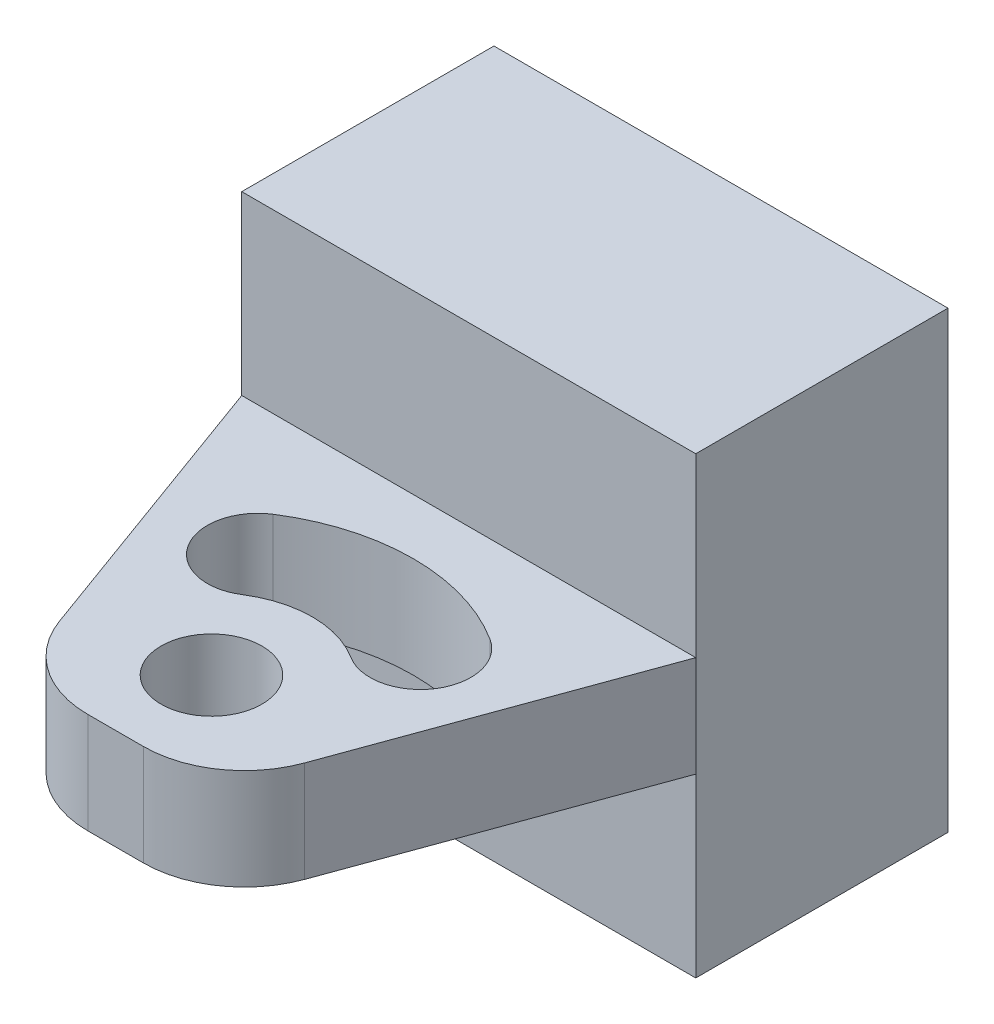
ISO-10303-21;
HEADER;
FILE_DESCRIPTION(('STEP AP214'),'2;1');
FILE_NAME('part.step','',(''),(''),'','','');
FILE_SCHEMA(('AUTOMOTIVE_DESIGN { 1 0 10303 214 1 1 1 1 }'));
ENDSEC;
DATA;
#1=APPLICATION_CONTEXT('core data for automotive mechanical design processes');
#2=APPLICATION_PROTOCOL_DEFINITION('international standard','automotive_design',2000,#1);
#3=PRODUCT_CONTEXT('',#1,'mechanical');
#4=PRODUCT('Part','Part','',(#3));
#5=PRODUCT_RELATED_PRODUCT_CATEGORY('part','',(#4));
#6=PRODUCT_DEFINITION_FORMATION('','',#4);
#7=PRODUCT_DEFINITION_CONTEXT('part definition',#1,'design');
#8=PRODUCT_DEFINITION('design','',#6,#7);
#9=PRODUCT_DEFINITION_SHAPE('','',#8);
#10=(LENGTH_UNIT() NAMED_UNIT(*) SI_UNIT(.MILLI.,.METRE.));
#11=(NAMED_UNIT(*) PLANE_ANGLE_UNIT() SI_UNIT($,.RADIAN.));
#12=(NAMED_UNIT(*) SI_UNIT($,.STERADIAN.) SOLID_ANGLE_UNIT());
#13=UNCERTAINTY_MEASURE_WITH_UNIT(LENGTH_MEASURE(1.E-05),#10,'distance_accuracy_value','');
#14=(GEOMETRIC_REPRESENTATION_CONTEXT(3) GLOBAL_UNCERTAINTY_ASSIGNED_CONTEXT((#13)) GLOBAL_UNIT_ASSIGNED_CONTEXT((#10,
#11,#12)) REPRESENTATION_CONTEXT('',''));
#15=CARTESIAN_POINT('',(0.,0.,0.));
#16=DIRECTION('',(0.,0.,1.));
#17=DIRECTION('',(1.,0.,0.));
#18=AXIS2_PLACEMENT_3D('',#15,#16,#17);
#19=CARTESIAN_POINT('',(0.,0.,25.));
#20=DIRECTION('',(1.,0.,0.));
#21=DIRECTION('',(0.,1.,0.));
#22=AXIS2_PLACEMENT_3D('',#19,#20,#21);
#23=PLANE('',#22);
#24=DIRECTION('',(0.,-1.,0.));
#25=VECTOR('',#24,1.);
#26=CARTESIAN_POINT('',(0.,45.,25.));
#27=LINE('',#26,#25);
#28=CARTESIAN_POINT('',(0.,27.5,25.));
#29=VERTEX_POINT('',#28);
#30=CARTESIAN_POINT('',(0.,17.5,25.));
#31=VERTEX_POINT('',#30);
#32=EDGE_CURVE('E140',#29,#31,#27,.T.);
#33=ORIENTED_EDGE('',*,*,#32,.F.);
#34=DIRECTION('',(0.,-1.,0.));
#35=VECTOR('',#34,1.);
#36=CARTESIAN_POINT('',(0.,0.,25.));
#37=LINE('',#36,#35);
#38=CARTESIAN_POINT('',(0.,45.,25.));
#39=VERTEX_POINT('',#38);
#40=EDGE_CURVE('E153',#39,#29,#37,.T.);
#41=ORIENTED_EDGE('',*,*,#40,.F.);
#42=DIRECTION('',(0.,0.,-1.));
#43=VECTOR('',#42,1.);
#44=CARTESIAN_POINT('',(0.,45.,25.));
#45=LINE('',#44,#43);
#46=CARTESIAN_POINT('',(0.,45.,0.));
#47=VERTEX_POINT('',#46);
#48=EDGE_CURVE('E195',#39,#47,#45,.T.);
#49=ORIENTED_EDGE('',*,*,#48,.T.);
#50=DIRECTION('',(0.,-1.,0.));
#51=VECTOR('',#50,1.);
#52=CARTESIAN_POINT('',(0.,0.,0.));
#53=LINE('',#52,#51);
#54=CARTESIAN_POINT('',(0.,0.,0.));
#55=VERTEX_POINT('',#54);
#56=EDGE_CURVE('E196',#47,#55,#53,.T.);
#57=ORIENTED_EDGE('',*,*,#56,.T.);
#58=DIRECTION('',(0.,0.,-1.));
#59=VECTOR('',#58,1.);
#60=CARTESIAN_POINT('',(0.,0.,25.));
#61=LINE('',#60,#59);
#62=CARTESIAN_POINT('',(0.,0.,25.));
#63=VERTEX_POINT('',#62);
#64=EDGE_CURVE('E219',#63,#55,#61,.T.);
#65=ORIENTED_EDGE('',*,*,#64,.F.);
#66=EDGE_CURVE('E155',#31,#63,#37,.T.);
#67=ORIENTED_EDGE('',*,*,#66,.F.);
#68=EDGE_LOOP('',(#33,#41,#49,#57,#65,#67));
#69=FACE_BOUND('',#68,.T.);
#70=ADVANCED_FACE('F37',(#69),#23,.F.);
#71=CARTESIAN_POINT('',(45.,0.,25.));
#72=DIRECTION('',(-1.,0.,0.));
#73=DIRECTION('',(0.,-1.,0.));
#74=AXIS2_PLACEMENT_3D('',#71,#72,#73);
#75=PLANE('',#74);
#76=DIRECTION('',(0.,-1.,0.));
#77=VECTOR('',#76,1.);
#78=CARTESIAN_POINT('',(45.,45.,25.));
#79=LINE('',#78,#77);
#80=CARTESIAN_POINT('',(45.,27.5,25.));
#81=VERTEX_POINT('',#80);
#82=CARTESIAN_POINT('',(45.,17.5,25.));
#83=VERTEX_POINT('',#82);
#84=EDGE_CURVE('E146',#81,#83,#79,.T.);
#85=ORIENTED_EDGE('',*,*,#84,.T.);
#86=DIRECTION('',(0.,1.,0.));
#87=VECTOR('',#86,1.);
#88=CARTESIAN_POINT('',(45.,0.,25.));
#89=LINE('',#88,#87);
#90=CARTESIAN_POINT('',(45.,0.,25.));
#91=VERTEX_POINT('',#90);
#92=EDGE_CURVE('E189',#91,#83,#89,.T.);
#93=ORIENTED_EDGE('',*,*,#92,.F.);
#94=DIRECTION('',(0.,0.,-1.));
#95=VECTOR('',#94,1.);
#96=CARTESIAN_POINT('',(45.,0.,25.));
#97=LINE('',#96,#95);
#98=CARTESIAN_POINT('',(45.,0.,0.));
#99=VERTEX_POINT('',#98);
#100=EDGE_CURVE('E215',#91,#99,#97,.T.);
#101=ORIENTED_EDGE('',*,*,#100,.T.);
#102=DIRECTION('',(0.,1.,0.));
#103=VECTOR('',#102,1.);
#104=CARTESIAN_POINT('',(45.,0.,0.));
#105=LINE('',#104,#103);
#106=CARTESIAN_POINT('',(45.,45.,0.));
#107=VERTEX_POINT('',#106);
#108=EDGE_CURVE('E203',#99,#107,#105,.T.);
#109=ORIENTED_EDGE('',*,*,#108,.T.);
#110=DIRECTION('',(0.,0.,-1.));
#111=VECTOR('',#110,1.);
#112=CARTESIAN_POINT('',(45.,45.,25.));
#113=LINE('',#112,#111);
#114=CARTESIAN_POINT('',(45.,45.,25.));
#115=VERTEX_POINT('',#114);
#116=EDGE_CURVE('E211',#115,#107,#113,.T.);
#117=ORIENTED_EDGE('',*,*,#116,.F.);
#118=EDGE_CURVE('E188',#81,#115,#89,.T.);
#119=ORIENTED_EDGE('',*,*,#118,.F.);
#120=EDGE_LOOP('',(#85,#93,#101,#109,#117,#119));
#121=FACE_BOUND('',#120,.T.);
#122=ADVANCED_FACE('F343',(#121),#75,.F.);
#123=CARTESIAN_POINT('',(0.,17.5,60.));
#124=DIRECTION('',(0.,1.,0.));
#125=DIRECTION('',(0.,0.,1.));
#126=AXIS2_PLACEMENT_3D('',#123,#124,#125);
#127=PLANE('',#126);
#128=CARTESIAN_POINT('',(22.5,17.5,50.5));
#129=DIRECTION('',(0.,-1.,0.));
#130=DIRECTION('',(0.,0.,-1.));
#131=AXIS2_PLACEMENT_3D('',#128,#129,#130);
#132=CIRCLE('',#131,5.);
#133=CARTESIAN_POINT('',(22.5,17.5,45.5));
#134=VERTEX_POINT('',#133);
#135=EDGE_CURVE('E243',#134,#134,#132,.T.);
#136=ORIENTED_EDGE('',*,*,#135,.F.);
#137=EDGE_LOOP('',(#136));
#138=FACE_BOUND('',#137,.T.);
#139=CARTESIAN_POINT('',(14.4405058747976,17.5,37.8491283128067));
#140=DIRECTION('',(0.,-1.,0.));
#141=DIRECTION('',(0.,0.,-1.));
#142=AXIS2_PLACEMENT_3D('',#139,#140,#141);
#143=CIRCLE('',#142,5.);
#144=CARTESIAN_POINT('',(17.1270039165317,17.5,42.0660855418711));
#145=VERTEX_POINT('',#144);
#146=CARTESIAN_POINT('',(11.7540078330635,17.5,33.6321710837423));
#147=VERTEX_POINT('',#146);
#148=EDGE_CURVE('E290',#145,#147,#143,.T.);
#149=ORIENTED_EDGE('',*,*,#148,.F.);
#150=CARTESIAN_POINT('',(22.5,17.5,50.5));
#151=DIRECTION('',(0.,1.,0.));
#152=DIRECTION('',(0.,0.,-1.));
#153=AXIS2_PLACEMENT_3D('',#150,#151,#152);
#154=CIRCLE('',#153,10.);
#155=CARTESIAN_POINT('',(27.8729960834682,17.5,42.0660855418711));
#156=VERTEX_POINT('',#155);
#157=EDGE_CURVE('E283',#156,#145,#154,.T.);
#158=ORIENTED_EDGE('',*,*,#157,.F.);
#159=CARTESIAN_POINT('',(30.5594941252023,17.5,37.8491283128067));
#160=DIRECTION('',(0.,-1.,0.));
#161=DIRECTION('',(0.,0.,-1.));
#162=AXIS2_PLACEMENT_3D('',#159,#160,#161);
#163=CIRCLE('',#162,5.00000000000001);
#164=CARTESIAN_POINT('',(33.2459921669364,17.5,33.6321710837422));
#165=VERTEX_POINT('',#164);
#166=EDGE_CURVE('E298',#165,#156,#163,.T.);
#167=ORIENTED_EDGE('',*,*,#166,.F.);
#168=CARTESIAN_POINT('',(22.5,17.5,50.5));
#169=DIRECTION('',(0.,-1.,0.));
#170=DIRECTION('',(0.,0.,-1.));
#171=AXIS2_PLACEMENT_3D('',#168,#169,#170);
#172=CIRCLE('',#171,20.);
#173=EDGE_CURVE('E294',#147,#165,#172,.T.);
#174=ORIENTED_EDGE('',*,*,#173,.F.);
#175=EDGE_LOOP('',(#149,#158,#167,#174));
#176=FACE_BOUND('',#175,.T.);
#177=DIRECTION('',(1.,0.,0.));
#178=VECTOR('',#177,1.);
#179=CARTESIAN_POINT('',(0.,17.5,60.));
#180=LINE('',#179,#178);
#181=CARTESIAN_POINT('',(19.741033581414,17.5,60.));
#182=VERTEX_POINT('',#181);
#183=CARTESIAN_POINT('',(25.258966418586,17.5,60.));
#184=VERTEX_POINT('',#183);
#185=EDGE_CURVE('E172',#182,#184,#180,.T.);
#186=ORIENTED_EDGE('',*,*,#185,.F.);
#187=CARTESIAN_POINT('',(19.741033581414,17.5,50.));
#188=DIRECTION('',(0.,1.,0.));
#189=DIRECTION('',(0.,0.,1.));
#190=AXIS2_PLACEMENT_3D('',#187,#188,#189);
#191=CIRCLE('',#190,10.);
#192=CARTESIAN_POINT('',(10.3441073735549,17.5,53.4202014332566));
#193=VERTEX_POINT('',#192);
#194=EDGE_CURVE('E254',#182,#193,#191,.F.);
#195=ORIENTED_EDGE('',*,*,#194,.T.);
#196=DIRECTION('',(0.342020143325663,0.,0.939692620785911));
#197=VECTOR('',#196,1.);
#198=CARTESIAN_POINT('',(11.2487831695143,17.5,55.9057777545823));
#199=LINE('',#198,#197);
#200=EDGE_CURVE('E145',#31,#193,#199,.T.);
#201=ORIENTED_EDGE('',*,*,#200,.F.);
#202=DIRECTION('',(1.,0.,0.));
#203=VECTOR('',#202,1.);
#204=CARTESIAN_POINT('',(0.,17.5,25.));
#205=LINE('',#204,#203);
#206=EDGE_CURVE('E173',#31,#83,#205,.T.);
#207=ORIENTED_EDGE('',*,*,#206,.T.);
#208=DIRECTION('',(0.342020143325663,0.,-0.939692620785911));
#209=VECTOR('',#208,1.);
#210=CARTESIAN_POINT('',(28.4872168006629,17.5,70.3684989725292));
#211=LINE('',#210,#209);
#212=CARTESIAN_POINT('',(34.6558926264451,17.5,53.4202014332566));
#213=VERTEX_POINT('',#212);
#214=EDGE_CURVE('E278',#213,#83,#211,.T.);
#215=ORIENTED_EDGE('',*,*,#214,.F.);
#216=CARTESIAN_POINT('',(25.258966418586,17.5,50.));
#217=DIRECTION('',(0.,1.,0.));
#218=DIRECTION('',(0.,0.,1.));
#219=AXIS2_PLACEMENT_3D('',#216,#217,#218);
#220=CIRCLE('',#219,10.);
#221=EDGE_CURVE('E251',#213,#184,#220,.F.);
#222=ORIENTED_EDGE('',*,*,#221,.T.);
#223=EDGE_LOOP('',(#186,#195,#201,#207,#215,#222));
#224=FACE_BOUND('',#223,.T.);
#225=ADVANCED_FACE('F272',(#138,#176,#224),#127,.F.);
#226=CARTESIAN_POINT('',(0.,27.5,60.));
#227=DIRECTION('',(0.,-1.,0.));
#228=DIRECTION('',(0.,0.,-1.));
#229=AXIS2_PLACEMENT_3D('',#226,#227,#228);
#230=PLANE('',#229);
#231=CARTESIAN_POINT('',(22.5,27.5,50.5));
#232=DIRECTION('',(0.,-1.,0.));
#233=DIRECTION('',(0.,0.,-1.));
#234=AXIS2_PLACEMENT_3D('',#231,#232,#233);
#235=CIRCLE('',#234,5.);
#236=CARTESIAN_POINT('',(22.5,27.5,45.5));
#237=VERTEX_POINT('',#236);
#238=EDGE_CURVE('E182',#237,#237,#235,.T.);
#239=ORIENTED_EDGE('',*,*,#238,.T.);
#240=EDGE_LOOP('',(#239));
#241=FACE_BOUND('',#240,.T.);
#242=CARTESIAN_POINT('',(30.5594941252023,27.5,37.8491283128067));
#243=DIRECTION('',(0.,-1.,0.));
#244=DIRECTION('',(0.,0.,-1.));
#245=AXIS2_PLACEMENT_3D('',#242,#243,#244);
#246=CIRCLE('',#245,5.00000000000001);
#247=CARTESIAN_POINT('',(33.2459921669364,27.5,33.6321710837422));
#248=VERTEX_POINT('',#247);
#249=CARTESIAN_POINT('',(27.8729960834682,27.5,42.0660855418711));
#250=VERTEX_POINT('',#249);
#251=EDGE_CURVE('E231',#248,#250,#246,.T.);
#252=ORIENTED_EDGE('',*,*,#251,.T.);
#253=CARTESIAN_POINT('',(22.5,27.5,50.5));
#254=DIRECTION('',(0.,-1.,0.));
#255=DIRECTION('',(0.,0.,-1.));
#256=AXIS2_PLACEMENT_3D('',#253,#254,#255);
#257=CIRCLE('',#256,10.);
#258=CARTESIAN_POINT('',(17.1270039165317,27.5,42.0660855418711));
#259=VERTEX_POINT('',#258);
#260=EDGE_CURVE('E235',#250,#259,#257,.F.);
#261=ORIENTED_EDGE('',*,*,#260,.T.);
#262=CARTESIAN_POINT('',(14.4405058747976,27.5,37.8491283128067));
#263=DIRECTION('',(0.,-1.,0.));
#264=DIRECTION('',(0.,0.,-1.));
#265=AXIS2_PLACEMENT_3D('',#262,#263,#264);
#266=CIRCLE('',#265,5.);
#267=CARTESIAN_POINT('',(11.7540078330635,27.5,33.6321710837423));
#268=VERTEX_POINT('',#267);
#269=EDGE_CURVE('E223',#259,#268,#266,.T.);
#270=ORIENTED_EDGE('',*,*,#269,.T.);
#271=CARTESIAN_POINT('',(22.5,27.5,50.5));
#272=DIRECTION('',(0.,-1.,0.));
#273=DIRECTION('',(0.,0.,-1.));
#274=AXIS2_PLACEMENT_3D('',#271,#272,#273);
#275=CIRCLE('',#274,20.);
#276=EDGE_CURVE('E227',#268,#248,#275,.T.);
#277=ORIENTED_EDGE('',*,*,#276,.T.);
#278=EDGE_LOOP('',(#252,#261,#270,#277));
#279=FACE_BOUND('',#278,.T.);
#280=DIRECTION('',(-0.342020143325663,0.,-0.939692620785911));
#281=VECTOR('',#280,1.);
#282=CARTESIAN_POINT('',(11.2487831695143,27.5,55.9057777545823));
#283=LINE('',#282,#281);
#284=CARTESIAN_POINT('',(10.3441073735549,27.5,53.4202014332566));
#285=VERTEX_POINT('',#284);
#286=EDGE_CURVE('E137',#285,#29,#283,.T.);
#287=ORIENTED_EDGE('',*,*,#286,.F.);
#288=CARTESIAN_POINT('',(19.741033581414,27.5,50.));
#289=DIRECTION('',(0.,-1.,0.));
#290=DIRECTION('',(0.,0.,-1.));
#291=AXIS2_PLACEMENT_3D('',#288,#289,#290);
#292=CIRCLE('',#291,10.);
#293=CARTESIAN_POINT('',(19.741033581414,27.5,60.));
#294=VERTEX_POINT('',#293);
#295=EDGE_CURVE('E46',#285,#294,#292,.F.);
#296=ORIENTED_EDGE('',*,*,#295,.T.);
#297=DIRECTION('',(-1.,0.,0.));
#298=VECTOR('',#297,1.);
#299=CARTESIAN_POINT('',(0.,27.5,60.));
#300=LINE('',#299,#298);
#301=CARTESIAN_POINT('',(25.258966418586,27.5,60.));
#302=VERTEX_POINT('',#301);
#303=EDGE_CURVE('E179',#302,#294,#300,.T.);
#304=ORIENTED_EDGE('',*,*,#303,.F.);
#305=CARTESIAN_POINT('',(25.258966418586,27.5,50.));
#306=DIRECTION('',(0.,-1.,0.));
#307=DIRECTION('',(0.,0.,-1.));
#308=AXIS2_PLACEMENT_3D('',#305,#306,#307);
#309=CIRCLE('',#308,10.);
#310=CARTESIAN_POINT('',(34.6558926264451,27.5,53.4202014332566));
#311=VERTEX_POINT('',#310);
#312=EDGE_CURVE('E53',#302,#311,#309,.F.);
#313=ORIENTED_EDGE('',*,*,#312,.T.);
#314=DIRECTION('',(-0.342020143325663,0.,0.939692620785911));
#315=VECTOR('',#314,1.);
#316=CARTESIAN_POINT('',(28.4872168006629,27.5,70.3684989725292));
#317=LINE('',#316,#315);
#318=EDGE_CURVE('E170',#81,#311,#317,.T.);
#319=ORIENTED_EDGE('',*,*,#318,.F.);
#320=DIRECTION('',(-1.,0.,0.));
#321=VECTOR('',#320,1.);
#322=CARTESIAN_POINT('',(0.,27.5,25.));
#323=LINE('',#322,#321);
#324=EDGE_CURVE('E161',#81,#29,#323,.T.);
#325=ORIENTED_EDGE('',*,*,#324,.T.);
#326=EDGE_LOOP('',(#287,#296,#304,#313,#319,#325));
#327=FACE_BOUND('',#326,.T.);
#328=ADVANCED_FACE('F169',(#241,#279,#327),#230,.F.);
#329=CARTESIAN_POINT('',(0.,0.,60.));
#330=DIRECTION('',(0.,0.,1.));
#331=DIRECTION('',(1.,0.,0.));
#332=AXIS2_PLACEMENT_3D('',#329,#330,#331);
#333=PLANE('',#332);
#334=ORIENTED_EDGE('',*,*,#303,.T.);
#335=DIRECTION('',(0.,-1.,0.));
#336=VECTOR('',#335,1.);
#337=CARTESIAN_POINT('',(19.741033581414,0.,60.));
#338=LINE('',#337,#336);
#339=EDGE_CURVE('E247',#294,#182,#338,.T.);
#340=ORIENTED_EDGE('',*,*,#339,.T.);
#341=ORIENTED_EDGE('',*,*,#185,.T.);
#342=DIRECTION('',(0.,1.,0.));
#343=VECTOR('',#342,1.);
#344=CARTESIAN_POINT('',(25.258966418586,0.,60.));
#345=LINE('',#344,#343);
#346=EDGE_CURVE('E239',#184,#302,#345,.T.);
#347=ORIENTED_EDGE('',*,*,#346,.T.);
#348=EDGE_LOOP('',(#334,#340,#341,#347));
#349=FACE_BOUND('',#348,.T.);
#350=ADVANCED_FACE('F266',(#349),#333,.T.);
#351=CARTESIAN_POINT('',(0.,0.,25.));
#352=DIRECTION('',(0.,0.,-1.));
#353=DIRECTION('',(-1.,0.,0.));
#354=AXIS2_PLACEMENT_3D('',#351,#352,#353);
#355=PLANE('',#354);
#356=ORIENTED_EDGE('',*,*,#324,.F.);
#357=ORIENTED_EDGE('',*,*,#118,.T.);
#358=DIRECTION('',(-1.,0.,0.));
#359=VECTOR('',#358,1.);
#360=CARTESIAN_POINT('',(0.,45.,25.));
#361=LINE('',#360,#359);
#362=EDGE_CURVE('E164',#115,#39,#361,.T.);
#363=ORIENTED_EDGE('',*,*,#362,.T.);
#364=ORIENTED_EDGE('',*,*,#40,.T.);
#365=EDGE_LOOP('',(#356,#357,#363,#364));
#366=FACE_BOUND('',#365,.T.);
#367=ADVANCED_FACE('F160',(#366),#355,.F.);
#368=ORIENTED_EDGE('',*,*,#206,.F.);
#369=ORIENTED_EDGE('',*,*,#66,.T.);
#370=DIRECTION('',(1.,0.,0.));
#371=VECTOR('',#370,1.);
#372=CARTESIAN_POINT('',(0.,0.,25.));
#373=LINE('',#372,#371);
#374=EDGE_CURVE('E167',#63,#91,#373,.T.);
#375=ORIENTED_EDGE('',*,*,#374,.T.);
#376=ORIENTED_EDGE('',*,*,#92,.T.);
#377=EDGE_LOOP('',(#368,#369,#375,#376));
#378=FACE_BOUND('',#377,.T.);
#379=ADVANCED_FACE('F388',(#378),#355,.F.);
#380=CARTESIAN_POINT('',(0.,0.,25.));
#381=DIRECTION('',(0.,1.,0.));
#382=DIRECTION('',(0.,0.,1.));
#383=AXIS2_PLACEMENT_3D('',#380,#381,#382);
#384=PLANE('',#383);
#385=DIRECTION('',(1.,0.,0.));
#386=VECTOR('',#385,1.);
#387=CARTESIAN_POINT('',(0.,0.,0.));
#388=LINE('',#387,#386);
#389=EDGE_CURVE('E200',#55,#99,#388,.T.);
#390=ORIENTED_EDGE('',*,*,#389,.T.);
#391=ORIENTED_EDGE('',*,*,#100,.F.);
#392=ORIENTED_EDGE('',*,*,#374,.F.);
#393=ORIENTED_EDGE('',*,*,#64,.T.);
#394=EDGE_LOOP('',(#390,#391,#392,#393));
#395=FACE_BOUND('',#394,.T.);
#396=ADVANCED_FACE('F351',(#395),#384,.F.);
#397=CARTESIAN_POINT('',(0.,45.,25.));
#398=DIRECTION('',(0.,-1.,0.));
#399=DIRECTION('',(1.,0.,0.));
#400=AXIS2_PLACEMENT_3D('',#397,#398,#399);
#401=PLANE('',#400);
#402=DIRECTION('',(-1.,0.,0.));
#403=VECTOR('',#402,1.);
#404=CARTESIAN_POINT('',(0.,45.,0.));
#405=LINE('',#404,#403);
#406=EDGE_CURVE('E206',#107,#47,#405,.T.);
#407=ORIENTED_EDGE('',*,*,#406,.T.);
#408=ORIENTED_EDGE('',*,*,#48,.F.);
#409=ORIENTED_EDGE('',*,*,#362,.F.);
#410=ORIENTED_EDGE('',*,*,#116,.T.);
#411=EDGE_LOOP('',(#407,#408,#409,#410));
#412=FACE_BOUND('',#411,.T.);
#413=ADVANCED_FACE('F391',(#412),#401,.F.);
#414=CARTESIAN_POINT('',(0.,0.,0.));
#415=DIRECTION('',(0.,0.,-1.));
#416=DIRECTION('',(-1.,0.,0.));
#417=AXIS2_PLACEMENT_3D('',#414,#415,#416);
#418=PLANE('',#417);
#419=ORIENTED_EDGE('',*,*,#56,.F.);
#420=ORIENTED_EDGE('',*,*,#406,.F.);
#421=ORIENTED_EDGE('',*,*,#108,.F.);
#422=ORIENTED_EDGE('',*,*,#389,.F.);
#423=EDGE_LOOP('',(#419,#420,#421,#422));
#424=FACE_BOUND('',#423,.T.);
#425=ADVANCED_FACE('F339',(#424),#418,.T.);
#426=CARTESIAN_POINT('',(22.5,45.,50.5));
#427=DIRECTION('',(0.,-1.,0.));
#428=DIRECTION('',(0.,0.,-1.));
#429=AXIS2_PLACEMENT_3D('',#426,#427,#428);
#430=CYLINDRICAL_SURFACE('',#429,10.);
#431=DIRECTION('',(0.,-1.,0.));
#432=VECTOR('',#431,1.);
#433=CARTESIAN_POINT('',(27.8729960834682,45.,42.0660855418711));
#434=LINE('',#433,#432);
#435=EDGE_CURVE('E287',#250,#156,#434,.T.);
#436=ORIENTED_EDGE('',*,*,#435,.T.);
#437=ORIENTED_EDGE('',*,*,#157,.T.);
#438=DIRECTION('',(0.,-1.,0.));
#439=VECTOR('',#438,1.);
#440=CARTESIAN_POINT('',(17.1270039165317,45.,42.0660855418711));
#441=LINE('',#440,#439);
#442=EDGE_CURVE('E302',#259,#145,#441,.T.);
#443=ORIENTED_EDGE('',*,*,#442,.F.);
#444=ORIENTED_EDGE('',*,*,#260,.F.);
#445=EDGE_LOOP('',(#436,#437,#443,#444));
#446=FACE_BOUND('',#445,.T.);
#447=ADVANCED_FACE('F329',(#446),#430,.T.);
#448=CARTESIAN_POINT('',(30.5594941252023,45.,37.8491283128067));
#449=DIRECTION('',(0.,-1.,0.));
#450=DIRECTION('',(0.,0.,-1.));
#451=AXIS2_PLACEMENT_3D('',#448,#449,#450);
#452=CYLINDRICAL_SURFACE('',#451,5.00000000000001);
#453=DIRECTION('',(0.,-1.,0.));
#454=VECTOR('',#453,1.);
#455=CARTESIAN_POINT('',(33.2459921669364,45.,33.6321710837422));
#456=LINE('',#455,#454);
#457=EDGE_CURVE('E305',#248,#165,#456,.T.);
#458=ORIENTED_EDGE('',*,*,#457,.T.);
#459=ORIENTED_EDGE('',*,*,#166,.T.);
#460=ORIENTED_EDGE('',*,*,#435,.F.);
#461=ORIENTED_EDGE('',*,*,#251,.F.);
#462=EDGE_LOOP('',(#458,#459,#460,#461));
#463=FACE_BOUND('',#462,.T.);
#464=ADVANCED_FACE('F331',(#463),#452,.F.);
#465=CARTESIAN_POINT('',(22.5,45.,50.5));
#466=DIRECTION('',(0.,-1.,0.));
#467=DIRECTION('',(0.,0.,-1.));
#468=AXIS2_PLACEMENT_3D('',#465,#466,#467);
#469=CYLINDRICAL_SURFACE('',#468,20.);
#470=DIRECTION('',(0.,-1.,0.));
#471=VECTOR('',#470,1.);
#472=CARTESIAN_POINT('',(11.7540078330635,45.,33.6321710837423));
#473=LINE('',#472,#471);
#474=EDGE_CURVE('E308',#268,#147,#473,.T.);
#475=ORIENTED_EDGE('',*,*,#474,.T.);
#476=ORIENTED_EDGE('',*,*,#173,.T.);
#477=ORIENTED_EDGE('',*,*,#457,.F.);
#478=ORIENTED_EDGE('',*,*,#276,.F.);
#479=EDGE_LOOP('',(#475,#476,#477,#478));
#480=FACE_BOUND('',#479,.T.);
#481=ADVANCED_FACE('F325',(#480),#469,.F.);
#482=CARTESIAN_POINT('',(14.4405058747976,45.,37.8491283128067));
#483=DIRECTION('',(0.,-1.,0.));
#484=DIRECTION('',(0.,0.,-1.));
#485=AXIS2_PLACEMENT_3D('',#482,#483,#484);
#486=CYLINDRICAL_SURFACE('',#485,5.);
#487=ORIENTED_EDGE('',*,*,#442,.T.);
#488=ORIENTED_EDGE('',*,*,#148,.T.);
#489=ORIENTED_EDGE('',*,*,#474,.F.);
#490=ORIENTED_EDGE('',*,*,#269,.F.);
#491=EDGE_LOOP('',(#487,#488,#489,#490));
#492=FACE_BOUND('',#491,.T.);
#493=ADVANCED_FACE('F317',(#492),#486,.F.);
#494=CARTESIAN_POINT('',(22.5,45.,50.5));
#495=DIRECTION('',(0.,-1.,0.));
#496=DIRECTION('',(0.,0.,-1.));
#497=AXIS2_PLACEMENT_3D('',#494,#495,#496);
#498=CYLINDRICAL_SURFACE('',#497,5.);
#499=ORIENTED_EDGE('',*,*,#135,.T.);
#500=EDGE_LOOP('',(#499));
#501=FACE_BOUND('',#500,.T.);
#502=ORIENTED_EDGE('',*,*,#238,.F.);
#503=EDGE_LOOP('',(#502));
#504=FACE_BOUND('',#503,.T.);
#505=ADVANCED_FACE('F364',(#501,#504),#498,.F.);
#506=CARTESIAN_POINT('',(0.,45.,25.));
#507=DIRECTION('',(-0.93969262078591,0.,0.342020143325663));
#508=DIRECTION('',(0.342020143325663,0.,0.939692620785911));
#509=AXIS2_PLACEMENT_3D('',#506,#507,#508);
#510=PLANE('',#509);
#511=ORIENTED_EDGE('',*,*,#200,.T.);
#512=DIRECTION('',(0.,-1.,0.));
#513=VECTOR('',#512,1.);
#514=CARTESIAN_POINT('',(10.3441073735549,45.,53.4202014332566));
#515=LINE('',#514,#513);
#516=EDGE_CURVE('E61',#193,#285,#515,.F.);
#517=ORIENTED_EDGE('',*,*,#516,.T.);
#518=ORIENTED_EDGE('',*,*,#286,.T.);
#519=ORIENTED_EDGE('',*,*,#32,.T.);
#520=EDGE_LOOP('',(#511,#517,#518,#519));
#521=FACE_BOUND('',#520,.T.);
#522=ADVANCED_FACE('F139',(#521),#510,.T.);
#523=CARTESIAN_POINT('',(45.,45.,25.));
#524=DIRECTION('',(0.939692620785911,0.,0.342020143325663));
#525=DIRECTION('',(0.342020143325663,0.,-0.939692620785911));
#526=AXIS2_PLACEMENT_3D('',#523,#524,#525);
#527=PLANE('',#526);
#528=ORIENTED_EDGE('',*,*,#318,.T.);
#529=DIRECTION('',(0.,1.,0.));
#530=VECTOR('',#529,1.);
#531=CARTESIAN_POINT('',(34.6558926264451,45.,53.4202014332566));
#532=LINE('',#531,#530);
#533=EDGE_CURVE('E11',#311,#213,#532,.F.);
#534=ORIENTED_EDGE('',*,*,#533,.T.);
#535=ORIENTED_EDGE('',*,*,#214,.T.);
#536=ORIENTED_EDGE('',*,*,#84,.F.);
#537=EDGE_LOOP('',(#528,#534,#535,#536));
#538=FACE_BOUND('',#537,.T.);
#539=ADVANCED_FACE('F353',(#538),#527,.T.);
#540=CARTESIAN_POINT('',(19.741033581414,0.,50.));
#541=DIRECTION('',(0.,-1.,0.));
#542=DIRECTION('',(0.,0.,-1.));
#543=AXIS2_PLACEMENT_3D('',#540,#541,#542);
#544=CYLINDRICAL_SURFACE('',#543,10.);
#545=ORIENTED_EDGE('',*,*,#295,.F.);
#546=ORIENTED_EDGE('',*,*,#516,.F.);
#547=ORIENTED_EDGE('',*,*,#194,.F.);
#548=ORIENTED_EDGE('',*,*,#339,.F.);
#549=EDGE_LOOP('',(#545,#546,#547,#548));
#550=FACE_BOUND('',#549,.T.);
#551=ADVANCED_FACE('F270',(#550),#544,.T.);
#552=CARTESIAN_POINT('',(25.258966418586,0.,50.));
#553=DIRECTION('',(0.,1.,0.));
#554=DIRECTION('',(0.,0.,1.));
#555=AXIS2_PLACEMENT_3D('',#552,#553,#554);
#556=CYLINDRICAL_SURFACE('',#555,10.);
#557=ORIENTED_EDGE('',*,*,#221,.F.);
#558=ORIENTED_EDGE('',*,*,#533,.F.);
#559=ORIENTED_EDGE('',*,*,#312,.F.);
#560=ORIENTED_EDGE('',*,*,#346,.F.);
#561=EDGE_LOOP('',(#557,#558,#559,#560));
#562=FACE_BOUND('',#561,.T.);
#563=ADVANCED_FACE('F39',(#562),#556,.T.);
#564=CLOSED_SHELL('',(#70,#122,#225,#328,#350,#367,#379,#396,#413,#425,#447,#464,#481,#493,#505,
#522,#539,#551,#563));
#565=MANIFOLD_SOLID_BREP('B2',#564);
#566=ADVANCED_BREP_SHAPE_REPRESENTATION('',(#18,#565),#14);
#567=SHAPE_DEFINITION_REPRESENTATION(#9,#566);
ENDSEC;
END-ISO-10303-21;
